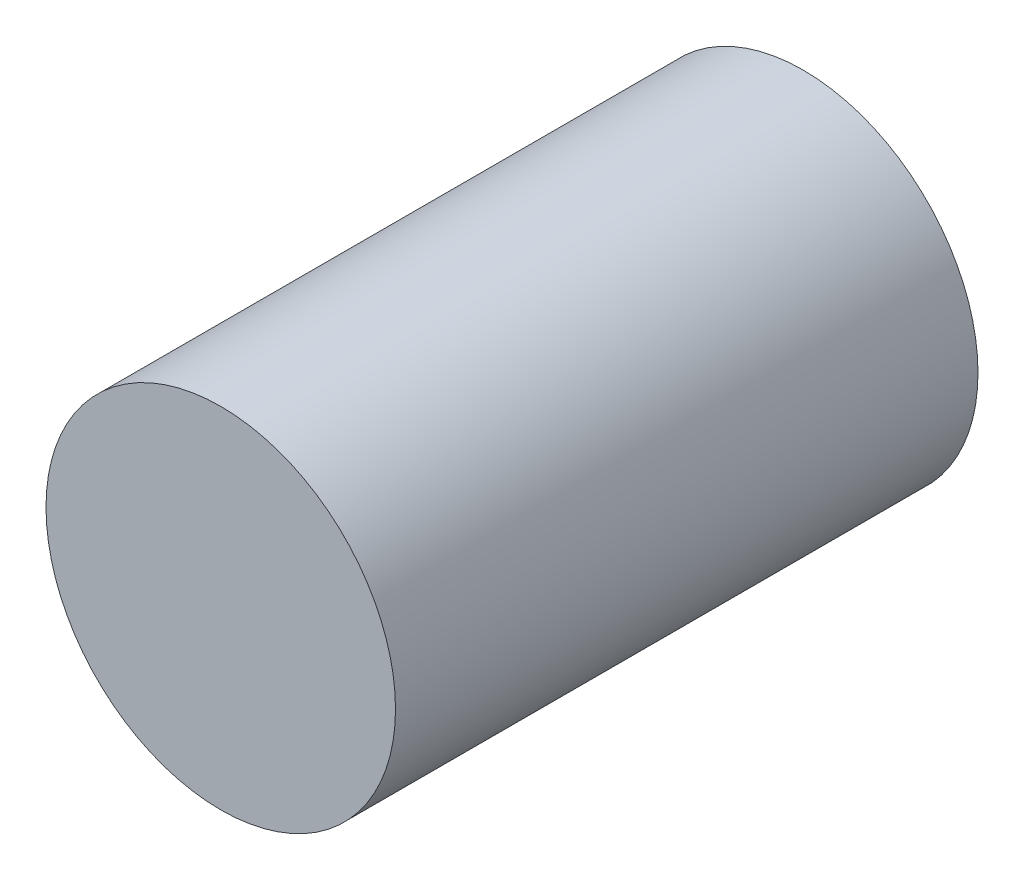
ISO-10303-21;
HEADER;
FILE_DESCRIPTION(('STEP AP214'),'2;1');
FILE_NAME('part.step','',(''),(''),'','','');
FILE_SCHEMA(('AUTOMOTIVE_DESIGN { 1 0 10303 214 1 1 1 1 }'));
ENDSEC;
DATA;
#1=APPLICATION_CONTEXT('core data for automotive mechanical design processes');
#2=APPLICATION_PROTOCOL_DEFINITION('international standard','automotive_design',2000,#1);
#3=PRODUCT_CONTEXT('',#1,'mechanical');
#4=PRODUCT('Part','Part','',(#3));
#5=PRODUCT_RELATED_PRODUCT_CATEGORY('part','',(#4));
#6=PRODUCT_DEFINITION_FORMATION('','',#4);
#7=PRODUCT_DEFINITION_CONTEXT('part definition',#1,'design');
#8=PRODUCT_DEFINITION('design','',#6,#7);
#9=PRODUCT_DEFINITION_SHAPE('','',#8);
#10=(LENGTH_UNIT() NAMED_UNIT(*) SI_UNIT(.MILLI.,.METRE.));
#11=(NAMED_UNIT(*) PLANE_ANGLE_UNIT() SI_UNIT($,.RADIAN.));
#12=(NAMED_UNIT(*) SI_UNIT($,.STERADIAN.) SOLID_ANGLE_UNIT());
#13=UNCERTAINTY_MEASURE_WITH_UNIT(LENGTH_MEASURE(1.E-05),#10,'distance_accuracy_value','');
#14=(GEOMETRIC_REPRESENTATION_CONTEXT(3) GLOBAL_UNCERTAINTY_ASSIGNED_CONTEXT((#13)) GLOBAL_UNIT_ASSIGNED_CONTEXT((#10,
#11,#12)) REPRESENTATION_CONTEXT('',''));
#15=CARTESIAN_POINT('',(0.,0.,0.));
#16=DIRECTION('',(0.,0.,1.));
#17=DIRECTION('',(1.,0.,0.));
#18=AXIS2_PLACEMENT_3D('',#15,#16,#17);
#19=CARTESIAN_POINT('',(0.,0.,45.));
#20=DIRECTION('',(0.,0.,-1.));
#21=DIRECTION('',(-1.,0.,0.));
#22=AXIS2_PLACEMENT_3D('',#19,#20,#21);
#23=CYLINDRICAL_SURFACE('',#22,13.5);
#24=CARTESIAN_POINT('',(0.,0.,45.));
#25=DIRECTION('',(0.,0.,1.));
#26=DIRECTION('',(1.,0.,0.));
#27=AXIS2_PLACEMENT_3D('',#24,#25,#26);
#28=CIRCLE('',#27,13.5);
#29=CARTESIAN_POINT('',(13.5,0.,45.));
#30=VERTEX_POINT('',#29);
#31=EDGE_CURVE('E10',#30,#30,#28,.T.);
#32=ORIENTED_EDGE('',*,*,#31,.F.);
#33=EDGE_LOOP('',(#32));
#34=FACE_BOUND('',#33,.T.);
#35=CARTESIAN_POINT('',(0.,0.,0.));
#36=DIRECTION('',(0.,0.,1.));
#37=DIRECTION('',(1.,0.,0.));
#38=AXIS2_PLACEMENT_3D('',#35,#36,#37);
#39=CIRCLE('',#38,13.5);
#40=CARTESIAN_POINT('',(13.5,0.,0.));
#41=VERTEX_POINT('',#40);
#42=EDGE_CURVE('E34',#41,#41,#39,.T.);
#43=ORIENTED_EDGE('',*,*,#42,.T.);
#44=EDGE_LOOP('',(#43));
#45=FACE_BOUND('',#44,.T.);
#46=ADVANCED_FACE('F31',(#34,#45),#23,.T.);
#47=CARTESIAN_POINT('',(0.,0.,45.));
#48=DIRECTION('',(0.,0.,1.));
#49=DIRECTION('',(1.,0.,0.));
#50=AXIS2_PLACEMENT_3D('',#47,#48,#49);
#51=PLANE('',#50);
#52=ORIENTED_EDGE('',*,*,#31,.T.);
#53=EDGE_LOOP('',(#52));
#54=FACE_BOUND('',#53,.T.);
#55=ADVANCED_FACE('F46',(#54),#51,.T.);
#56=CARTESIAN_POINT('',(0.,0.,0.));
#57=DIRECTION('',(0.,0.,1.));
#58=DIRECTION('',(1.,0.,0.));
#59=AXIS2_PLACEMENT_3D('',#56,#57,#58);
#60=PLANE('',#59);
#61=ORIENTED_EDGE('',*,*,#42,.F.);
#62=EDGE_LOOP('',(#61));
#63=FACE_BOUND('',#62,.T.);
#64=ADVANCED_FACE('F44',(#63),#60,.F.);
#65=CLOSED_SHELL('',(#46,#55,#64));
#66=MANIFOLD_SOLID_BREP('B2',#65);
#67=ADVANCED_BREP_SHAPE_REPRESENTATION('',(#18,#66),#14);
#68=SHAPE_DEFINITION_REPRESENTATION(#9,#67);
ENDSEC;
END-ISO-10303-21;
